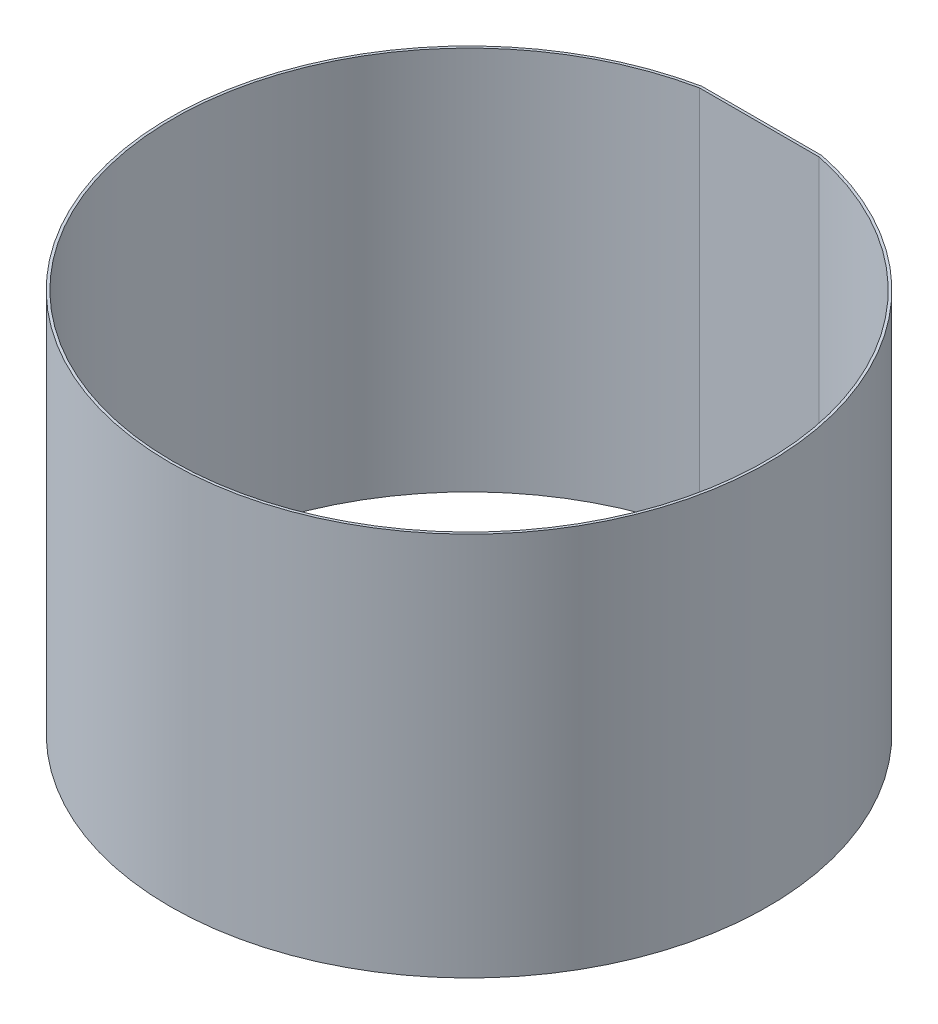
ISO-10303-21;
HEADER;
FILE_DESCRIPTION(('STEP AP214'),'2;1');
FILE_NAME('part.step','',(''),(''),'','','');
FILE_SCHEMA(('AUTOMOTIVE_DESIGN { 1 0 10303 214 1 1 1 1 }'));
ENDSEC;
DATA;
#1=APPLICATION_CONTEXT('core data for automotive mechanical design processes');
#2=APPLICATION_PROTOCOL_DEFINITION('international standard','automotive_design',2000,#1);
#3=PRODUCT_CONTEXT('',#1,'mechanical');
#4=PRODUCT('Part','Part','',(#3));
#5=PRODUCT_RELATED_PRODUCT_CATEGORY('part','',(#4));
#6=PRODUCT_DEFINITION_FORMATION('','',#4);
#7=PRODUCT_DEFINITION_CONTEXT('part definition',#1,'design');
#8=PRODUCT_DEFINITION('design','',#6,#7);
#9=PRODUCT_DEFINITION_SHAPE('','',#8);
#10=(LENGTH_UNIT() NAMED_UNIT(*) SI_UNIT(.MILLI.,.METRE.));
#11=(NAMED_UNIT(*) PLANE_ANGLE_UNIT() SI_UNIT($,.RADIAN.));
#12=(NAMED_UNIT(*) SI_UNIT($,.STERADIAN.) SOLID_ANGLE_UNIT());
#13=UNCERTAINTY_MEASURE_WITH_UNIT(LENGTH_MEASURE(1.E-05),#10,'distance_accuracy_value','');
#14=(GEOMETRIC_REPRESENTATION_CONTEXT(3) GLOBAL_UNCERTAINTY_ASSIGNED_CONTEXT((#13)) GLOBAL_UNIT_ASSIGNED_CONTEXT((#10,
#11,#12)) REPRESENTATION_CONTEXT('',''));
#15=CARTESIAN_POINT('',(0.,0.,0.));
#16=DIRECTION('',(0.,0.,1.));
#17=DIRECTION('',(1.,0.,0.));
#18=AXIS2_PLACEMENT_3D('',#15,#16,#17);
#19=CARTESIAN_POINT('',(0.,225.,-171.43307506192));
#20=DIRECTION('',(0.,0.,-1.));
#21=DIRECTION('',(-1.,0.,0.));
#22=AXIS2_PLACEMENT_3D('',#19,#20,#21);
#23=PLANE('',#22);
#24=DIRECTION('',(1.,0.,0.));
#25=VECTOR('',#24,1.);
#26=CARTESIAN_POINT('',(0.,0.,-171.43307506192));
#27=LINE('',#26,#25);
#28=CARTESIAN_POINT('',(-35.1525358233832,0.,-171.43307506192));
#29=VERTEX_POINT('',#28);
#30=CARTESIAN_POINT('',(35.1525358233832,0.,-171.43307506192));
#31=VERTEX_POINT('',#30);
#32=EDGE_CURVE('E98',#29,#31,#27,.T.);
#33=ORIENTED_EDGE('',*,*,#32,.F.);
#34=DIRECTION('',(0.,-1.,0.));
#35=VECTOR('',#34,1.);
#36=CARTESIAN_POINT('',(-35.1525358233832,225.,-171.43307506192));
#37=LINE('',#36,#35);
#38=CARTESIAN_POINT('',(-35.1525358233832,225.,-171.43307506192));
#39=VERTEX_POINT('',#38);
#40=EDGE_CURVE('E11',#39,#29,#37,.T.);
#41=ORIENTED_EDGE('',*,*,#40,.F.);
#42=DIRECTION('',(1.,0.,0.));
#43=VECTOR('',#42,1.);
#44=CARTESIAN_POINT('',(0.,225.,-171.43307506192));
#45=LINE('',#44,#43);
#46=CARTESIAN_POINT('',(35.1525358233832,225.,-171.43307506192));
#47=VERTEX_POINT('',#46);
#48=EDGE_CURVE('E88',#39,#47,#45,.T.);
#49=ORIENTED_EDGE('',*,*,#48,.T.);
#50=DIRECTION('',(0.,-1.,0.));
#51=VECTOR('',#50,1.);
#52=CARTESIAN_POINT('',(35.1525358233832,225.,-171.43307506192));
#53=LINE('',#52,#51);
#54=EDGE_CURVE('E45',#47,#31,#53,.T.);
#55=ORIENTED_EDGE('',*,*,#54,.T.);
#56=EDGE_LOOP('',(#33,#41,#49,#55));
#57=FACE_BOUND('',#56,.T.);
#58=ADVANCED_FACE('F35',(#57),#23,.T.);
#59=CARTESIAN_POINT('',(0.,225.,0.));
#60=DIRECTION('',(0.,-1.,0.));
#61=DIRECTION('',(0.,0.,-1.));
#62=AXIS2_PLACEMENT_3D('',#59,#60,#61);
#63=CYLINDRICAL_SURFACE('',#62,173.5);
#64=CARTESIAN_POINT('',(0.,0.,0.));
#65=DIRECTION('',(0.,1.,0.));
#66=DIRECTION('',(0.,0.,1.));
#67=AXIS2_PLACEMENT_3D('',#64,#65,#66);
#68=CIRCLE('',#67,173.5);
#69=CARTESIAN_POINT('',(-35.,0.,-169.93307506192));
#70=VERTEX_POINT('',#69);
#71=CARTESIAN_POINT('',(35.,0.,-169.93307506192));
#72=VERTEX_POINT('',#71);
#73=EDGE_CURVE('E103',#70,#72,#68,.T.);
#74=ORIENTED_EDGE('',*,*,#73,.F.);
#75=DIRECTION('',(0.,-1.,0.));
#76=VECTOR('',#75,1.);
#77=CARTESIAN_POINT('',(-35.,225.,-169.93307506192));
#78=LINE('',#77,#76);
#79=CARTESIAN_POINT('',(-35.,225.,-169.93307506192));
#80=VERTEX_POINT('',#79);
#81=EDGE_CURVE('E39',#80,#70,#78,.T.);
#82=ORIENTED_EDGE('',*,*,#81,.F.);
#83=CARTESIAN_POINT('',(0.,225.,0.));
#84=DIRECTION('',(0.,1.,0.));
#85=DIRECTION('',(0.,0.,1.));
#86=AXIS2_PLACEMENT_3D('',#83,#84,#85);
#87=CIRCLE('',#86,173.5);
#88=CARTESIAN_POINT('',(35.,225.,-169.93307506192));
#89=VERTEX_POINT('',#88);
#90=EDGE_CURVE('E86',#80,#89,#87,.T.);
#91=ORIENTED_EDGE('',*,*,#90,.T.);
#92=DIRECTION('',(0.,-1.,0.));
#93=VECTOR('',#92,1.);
#94=CARTESIAN_POINT('',(35.,225.,-169.93307506192));
#95=LINE('',#94,#93);
#96=EDGE_CURVE('E91',#89,#72,#95,.T.);
#97=ORIENTED_EDGE('',*,*,#96,.T.);
#98=EDGE_LOOP('',(#74,#82,#91,#97));
#99=FACE_BOUND('',#98,.T.);
#100=ADVANCED_FACE('F37',(#99),#63,.F.);
#101=CARTESIAN_POINT('',(0.,225.,-169.93307506192));
#102=DIRECTION('',(0.,0.,-1.));
#103=DIRECTION('',(-1.,0.,0.));
#104=AXIS2_PLACEMENT_3D('',#101,#102,#103);
#105=PLANE('',#104);
#106=DIRECTION('',(1.,0.,0.));
#107=VECTOR('',#106,1.);
#108=CARTESIAN_POINT('',(0.,0.,-169.93307506192));
#109=LINE('',#108,#107);
#110=EDGE_CURVE('E94',#70,#72,#109,.T.);
#111=ORIENTED_EDGE('',*,*,#110,.T.);
#112=ORIENTED_EDGE('',*,*,#96,.F.);
#113=DIRECTION('',(1.,0.,0.));
#114=VECTOR('',#113,1.);
#115=CARTESIAN_POINT('',(0.,225.,-169.93307506192));
#116=LINE('',#115,#114);
#117=EDGE_CURVE('E83',#80,#89,#116,.T.);
#118=ORIENTED_EDGE('',*,*,#117,.F.);
#119=ORIENTED_EDGE('',*,*,#81,.T.);
#120=EDGE_LOOP('',(#111,#112,#118,#119));
#121=FACE_BOUND('',#120,.T.);
#122=ADVANCED_FACE('F92',(#121),#105,.F.);
#123=CARTESIAN_POINT('',(0.,225.,0.));
#124=DIRECTION('',(0.,-1.,0.));
#125=DIRECTION('',(0.,0.,-1.));
#126=AXIS2_PLACEMENT_3D('',#123,#124,#125);
#127=CYLINDRICAL_SURFACE('',#126,175.);
#128=CARTESIAN_POINT('',(0.,0.,0.));
#129=DIRECTION('',(0.,1.,0.));
#130=DIRECTION('',(0.,0.,1.));
#131=AXIS2_PLACEMENT_3D('',#128,#129,#130);
#132=CIRCLE('',#131,175.);
#133=EDGE_CURVE('E96',#29,#31,#132,.T.);
#134=ORIENTED_EDGE('',*,*,#133,.T.);
#135=ORIENTED_EDGE('',*,*,#54,.F.);
#136=CARTESIAN_POINT('',(0.,225.,0.));
#137=DIRECTION('',(0.,1.,0.));
#138=DIRECTION('',(0.,0.,1.));
#139=AXIS2_PLACEMENT_3D('',#136,#137,#138);
#140=CIRCLE('',#139,175.);
#141=EDGE_CURVE('E53',#39,#47,#140,.T.);
#142=ORIENTED_EDGE('',*,*,#141,.F.);
#143=ORIENTED_EDGE('',*,*,#40,.T.);
#144=EDGE_LOOP('',(#134,#135,#142,#143));
#145=FACE_BOUND('',#144,.T.);
#146=ADVANCED_FACE('F113',(#145),#127,.T.);
#147=CARTESIAN_POINT('',(0.,225.,0.));
#148=DIRECTION('',(0.,1.,0.));
#149=DIRECTION('',(0.,0.,1.));
#150=AXIS2_PLACEMENT_3D('',#147,#148,#149);
#151=PLANE('',#150);
#152=ORIENTED_EDGE('',*,*,#90,.F.);
#153=ORIENTED_EDGE('',*,*,#117,.T.);
#154=EDGE_LOOP('',(#152,#153));
#155=FACE_BOUND('',#154,.T.);
#156=ORIENTED_EDGE('',*,*,#48,.F.);
#157=ORIENTED_EDGE('',*,*,#141,.T.);
#158=EDGE_LOOP('',(#156,#157));
#159=FACE_BOUND('',#158,.T.);
#160=ADVANCED_FACE('F85',(#155,#159),#151,.T.);
#161=CARTESIAN_POINT('',(0.,0.,0.));
#162=DIRECTION('',(0.,1.,0.));
#163=DIRECTION('',(0.,0.,1.));
#164=AXIS2_PLACEMENT_3D('',#161,#162,#163);
#165=PLANE('',#164);
#166=ORIENTED_EDGE('',*,*,#73,.T.);
#167=ORIENTED_EDGE('',*,*,#110,.F.);
#168=EDGE_LOOP('',(#166,#167));
#169=FACE_BOUND('',#168,.T.);
#170=ORIENTED_EDGE('',*,*,#32,.T.);
#171=ORIENTED_EDGE('',*,*,#133,.F.);
#172=EDGE_LOOP('',(#170,#171));
#173=FACE_BOUND('',#172,.T.);
#174=ADVANCED_FACE('F109',(#169,#173),#165,.F.);
#175=CLOSED_SHELL('',(#58,#100,#122,#146,#160,#174));
#176=MANIFOLD_SOLID_BREP('B2',#175);
#177=ADVANCED_BREP_SHAPE_REPRESENTATION('',(#18,#176),#14);
#178=SHAPE_DEFINITION_REPRESENTATION(#9,#177);
ENDSEC;
END-ISO-10303-21;
